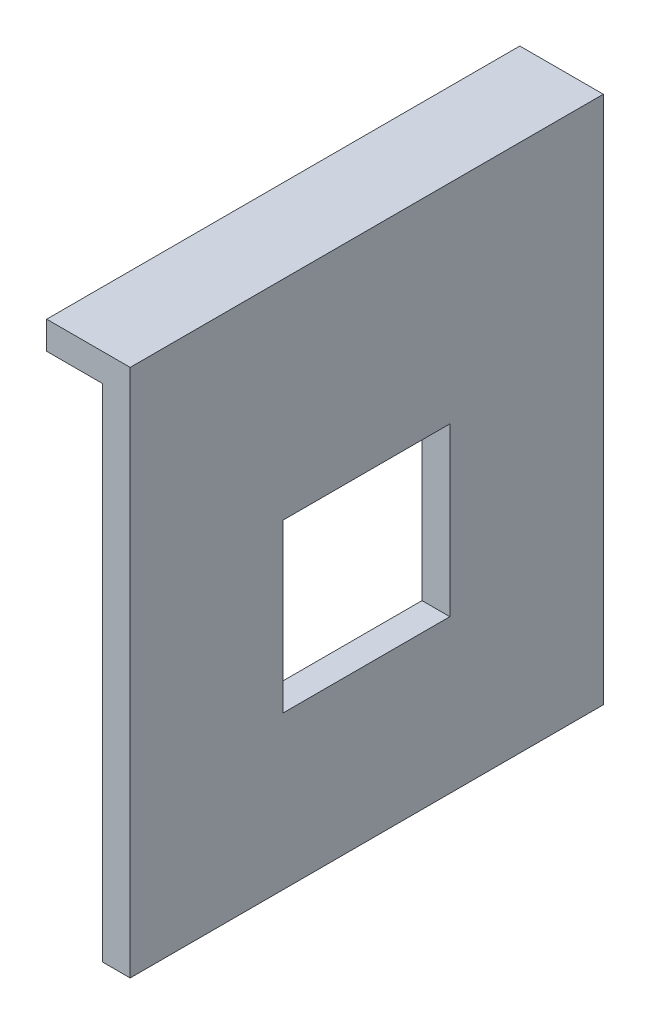
ISO-10303-21;
HEADER;
FILE_DESCRIPTION(('STEP AP214'),'2;1');
FILE_NAME('part.step','',(''),(''),'','','');
FILE_SCHEMA(('AUTOMOTIVE_DESIGN { 1 0 10303 214 1 1 1 1 }'));
ENDSEC;
DATA;
#1=APPLICATION_CONTEXT('core data for automotive mechanical design processes');
#2=APPLICATION_PROTOCOL_DEFINITION('international standard','automotive_design',2000,#1);
#3=PRODUCT_CONTEXT('',#1,'mechanical');
#4=PRODUCT('Part','Part','',(#3));
#5=PRODUCT_RELATED_PRODUCT_CATEGORY('part','',(#4));
#6=PRODUCT_DEFINITION_FORMATION('','',#4);
#7=PRODUCT_DEFINITION_CONTEXT('part definition',#1,'design');
#8=PRODUCT_DEFINITION('design','',#6,#7);
#9=PRODUCT_DEFINITION_SHAPE('','',#8);
#10=(LENGTH_UNIT() NAMED_UNIT(*) SI_UNIT(.MILLI.,.METRE.));
#11=(NAMED_UNIT(*) PLANE_ANGLE_UNIT() SI_UNIT($,.RADIAN.));
#12=(NAMED_UNIT(*) SI_UNIT($,.STERADIAN.) SOLID_ANGLE_UNIT());
#13=UNCERTAINTY_MEASURE_WITH_UNIT(LENGTH_MEASURE(1.E-05),#10,'distance_accuracy_value','');
#14=(GEOMETRIC_REPRESENTATION_CONTEXT(3) GLOBAL_UNCERTAINTY_ASSIGNED_CONTEXT((#13)) GLOBAL_UNIT_ASSIGNED_CONTEXT((#10,
#11,#12)) REPRESENTATION_CONTEXT('',''));
#15=CARTESIAN_POINT('',(0.,0.,0.));
#16=DIRECTION('',(0.,0.,1.));
#17=DIRECTION('',(1.,0.,0.));
#18=AXIS2_PLACEMENT_3D('',#15,#16,#17);
#19=CARTESIAN_POINT('',(-5.,95.,0.));
#20=DIRECTION('',(1.,0.,0.));
#21=DIRECTION('',(0.,0.,-1.));
#22=AXIS2_PLACEMENT_3D('',#19,#20,#21);
#23=PLANE('',#22);
#24=DIRECTION('',(0.,0.,1.));
#25=VECTOR('',#24,1.);
#26=CARTESIAN_POINT('',(-5.,90.,0.));
#27=LINE('',#26,#25);
#28=CARTESIAN_POINT('',(-5.,90.,0.));
#29=VERTEX_POINT('',#28);
#30=CARTESIAN_POINT('',(-4.99999999999999,90.,85.));
#31=VERTEX_POINT('',#30);
#32=EDGE_CURVE('E123',#29,#31,#27,.T.);
#33=ORIENTED_EDGE('',*,*,#32,.F.);
#34=DIRECTION('',(0.,-1.,0.));
#35=VECTOR('',#34,1.);
#36=CARTESIAN_POINT('',(-5.,95.,0.));
#37=LINE('',#36,#35);
#38=CARTESIAN_POINT('',(-5.,0.,0.));
#39=VERTEX_POINT('',#38);
#40=EDGE_CURVE('E187',#29,#39,#37,.T.);
#41=ORIENTED_EDGE('',*,*,#40,.T.);
#42=DIRECTION('',(0.,0.,1.));
#43=VECTOR('',#42,1.);
#44=CARTESIAN_POINT('',(-5.,0.,0.));
#45=LINE('',#44,#43);
#46=CARTESIAN_POINT('',(-4.99999999999999,0.,85.));
#47=VERTEX_POINT('',#46);
#48=EDGE_CURVE('E179',#39,#47,#45,.T.);
#49=ORIENTED_EDGE('',*,*,#48,.T.);
#50=DIRECTION('',(0.,-1.,0.));
#51=VECTOR('',#50,1.);
#52=CARTESIAN_POINT('',(-4.99999999999999,95.,85.));
#53=LINE('',#52,#51);
#54=EDGE_CURVE('E185',#31,#47,#53,.T.);
#55=ORIENTED_EDGE('',*,*,#54,.F.);
#56=EDGE_LOOP('',(#33,#41,#49,#55));
#57=FACE_BOUND('',#56,.T.);
#58=DIRECTION('',(0.,1.,0.));
#59=VECTOR('',#58,1.);
#60=CARTESIAN_POINT('',(-5.,27.5,27.5735931288071));
#61=LINE('',#60,#59);
#62=CARTESIAN_POINT('',(-5.,27.5,27.5735931288071));
#63=VERTEX_POINT('',#62);
#64=CARTESIAN_POINT('',(-5.,57.5,27.5735931288071));
#65=VERTEX_POINT('',#64);
#66=EDGE_CURVE('E57',#63,#65,#61,.T.);
#67=ORIENTED_EDGE('',*,*,#66,.T.);
#68=DIRECTION('',(0.,0.,1.));
#69=VECTOR('',#68,1.);
#70=CARTESIAN_POINT('',(-5.,57.5,27.5735931288071));
#71=LINE('',#70,#69);
#72=CARTESIAN_POINT('',(-4.99999999999999,57.5,57.5735931288071));
#73=VERTEX_POINT('',#72);
#74=EDGE_CURVE('E127',#65,#73,#71,.T.);
#75=ORIENTED_EDGE('',*,*,#74,.T.);
#76=DIRECTION('',(0.,1.,0.));
#77=VECTOR('',#76,1.);
#78=CARTESIAN_POINT('',(-4.99999999999999,27.5,57.5735931288071));
#79=LINE('',#78,#77);
#80=CARTESIAN_POINT('',(-4.99999999999999,27.5,57.5735931288071));
#81=VERTEX_POINT('',#80);
#82=EDGE_CURVE('E133',#81,#73,#79,.T.);
#83=ORIENTED_EDGE('',*,*,#82,.F.);
#84=DIRECTION('',(0.,0.,1.));
#85=VECTOR('',#84,1.);
#86=CARTESIAN_POINT('',(-5.,27.5,27.5735931288071));
#87=LINE('',#86,#85);
#88=EDGE_CURVE('E136',#63,#81,#87,.T.);
#89=ORIENTED_EDGE('',*,*,#88,.F.);
#90=EDGE_LOOP('',(#67,#75,#83,#89));
#91=FACE_BOUND('',#90,.T.);
#92=ADVANCED_FACE('F42',(#57,#91),#23,.F.);
#93=CARTESIAN_POINT('',(0.,95.,0.));
#94=DIRECTION('',(-1.,0.,0.));
#95=DIRECTION('',(0.,0.,1.));
#96=AXIS2_PLACEMENT_3D('',#93,#94,#95);
#97=PLANE('',#96);
#98=DIRECTION('',(0.,0.,-1.));
#99=VECTOR('',#98,1.);
#100=CARTESIAN_POINT('',(0.,0.,0.));
#101=LINE('',#100,#99);
#102=CARTESIAN_POINT('',(0.,0.,85.));
#103=VERTEX_POINT('',#102);
#104=CARTESIAN_POINT('',(0.,0.,0.));
#105=VERTEX_POINT('',#104);
#106=EDGE_CURVE('E164',#103,#105,#101,.T.);
#107=ORIENTED_EDGE('',*,*,#106,.T.);
#108=DIRECTION('',(0.,-1.,0.));
#109=VECTOR('',#108,1.);
#110=CARTESIAN_POINT('',(0.,95.,0.));
#111=LINE('',#110,#109);
#112=CARTESIAN_POINT('',(0.,95.,0.));
#113=VERTEX_POINT('',#112);
#114=EDGE_CURVE('E189',#113,#105,#111,.T.);
#115=ORIENTED_EDGE('',*,*,#114,.F.);
#116=DIRECTION('',(0.,0.,-1.));
#117=VECTOR('',#116,1.);
#118=CARTESIAN_POINT('',(0.,95.,0.));
#119=LINE('',#118,#117);
#120=CARTESIAN_POINT('',(0.,95.,85.));
#121=VERTEX_POINT('',#120);
#122=EDGE_CURVE('E165',#121,#113,#119,.T.);
#123=ORIENTED_EDGE('',*,*,#122,.F.);
#124=DIRECTION('',(0.,-1.,0.));
#125=VECTOR('',#124,1.);
#126=CARTESIAN_POINT('',(0.,95.,85.));
#127=LINE('',#126,#125);
#128=EDGE_CURVE('E173',#121,#103,#127,.T.);
#129=ORIENTED_EDGE('',*,*,#128,.T.);
#130=EDGE_LOOP('',(#107,#115,#123,#129));
#131=FACE_BOUND('',#130,.T.);
#132=DIRECTION('',(0.,1.,0.));
#133=VECTOR('',#132,1.);
#134=CARTESIAN_POINT('',(0.,95.,27.5735931288071));
#135=LINE('',#134,#133);
#136=CARTESIAN_POINT('',(0.,27.5,27.5735931288071));
#137=VERTEX_POINT('',#136);
#138=CARTESIAN_POINT('',(0.,57.5,27.5735931288071));
#139=VERTEX_POINT('',#138);
#140=EDGE_CURVE('E11',#137,#139,#135,.T.);
#141=ORIENTED_EDGE('',*,*,#140,.F.);
#142=DIRECTION('',(0.,0.,1.));
#143=VECTOR('',#142,1.);
#144=CARTESIAN_POINT('',(0.,27.5,0.));
#145=LINE('',#144,#143);
#146=CARTESIAN_POINT('',(0.,27.5,57.5735931288071));
#147=VERTEX_POINT('',#146);
#148=EDGE_CURVE('E192',#137,#147,#145,.T.);
#149=ORIENTED_EDGE('',*,*,#148,.T.);
#150=DIRECTION('',(0.,1.,0.));
#151=VECTOR('',#150,1.);
#152=CARTESIAN_POINT('',(0.,95.,57.5735931288071));
#153=LINE('',#152,#151);
#154=CARTESIAN_POINT('',(0.,57.5,57.5735931288071));
#155=VERTEX_POINT('',#154);
#156=EDGE_CURVE('E195',#147,#155,#153,.T.);
#157=ORIENTED_EDGE('',*,*,#156,.T.);
#158=DIRECTION('',(0.,0.,1.));
#159=VECTOR('',#158,1.);
#160=CARTESIAN_POINT('',(0.,57.5,0.));
#161=LINE('',#160,#159);
#162=EDGE_CURVE('E50',#139,#155,#161,.T.);
#163=ORIENTED_EDGE('',*,*,#162,.F.);
#164=EDGE_LOOP('',(#141,#149,#157,#163));
#165=FACE_BOUND('',#164,.T.);
#166=ADVANCED_FACE('F44',(#131,#165),#97,.F.);
#167=CARTESIAN_POINT('',(0.,95.,0.));
#168=DIRECTION('',(0.,0.,1.));
#169=DIRECTION('',(1.,0.,0.));
#170=AXIS2_PLACEMENT_3D('',#167,#168,#169);
#171=PLANE('',#170);
#172=DIRECTION('',(-1.,0.,0.));
#173=VECTOR('',#172,1.);
#174=CARTESIAN_POINT('',(0.,0.,0.));
#175=LINE('',#174,#173);
#176=EDGE_CURVE('E176',#105,#39,#175,.T.);
#177=ORIENTED_EDGE('',*,*,#176,.T.);
#178=ORIENTED_EDGE('',*,*,#40,.F.);
#179=DIRECTION('',(1.,0.,0.));
#180=VECTOR('',#179,1.);
#181=CARTESIAN_POINT('',(-15.,90.,0.));
#182=LINE('',#181,#180);
#183=CARTESIAN_POINT('',(-15.,90.,0.));
#184=VERTEX_POINT('',#183);
#185=EDGE_CURVE('E161',#184,#29,#182,.T.);
#186=ORIENTED_EDGE('',*,*,#185,.F.);
#187=DIRECTION('',(0.,-1.,0.));
#188=VECTOR('',#187,1.);
#189=CARTESIAN_POINT('',(-15.,95.,0.));
#190=LINE('',#189,#188);
#191=CARTESIAN_POINT('',(-15.,95.,0.));
#192=VERTEX_POINT('',#191);
#193=EDGE_CURVE('E145',#192,#184,#190,.T.);
#194=ORIENTED_EDGE('',*,*,#193,.F.);
#195=DIRECTION('',(-1.,0.,0.));
#196=VECTOR('',#195,1.);
#197=CARTESIAN_POINT('',(0.,95.,0.));
#198=LINE('',#197,#196);
#199=EDGE_CURVE('E168',#113,#192,#198,.T.);
#200=ORIENTED_EDGE('',*,*,#199,.F.);
#201=ORIENTED_EDGE('',*,*,#114,.T.);
#202=EDGE_LOOP('',(#177,#178,#186,#194,#200,#201));
#203=FACE_BOUND('',#202,.T.);
#204=ADVANCED_FACE('F213',(#203),#171,.F.);
#205=CARTESIAN_POINT('',(0.,95.,85.));
#206=DIRECTION('',(0.,0.,-1.));
#207=DIRECTION('',(-1.,0.,0.));
#208=AXIS2_PLACEMENT_3D('',#205,#206,#207);
#209=PLANE('',#208);
#210=DIRECTION('',(1.,0.,0.));
#211=VECTOR('',#210,1.);
#212=CARTESIAN_POINT('',(0.,0.,85.));
#213=LINE('',#212,#211);
#214=EDGE_CURVE('E169',#47,#103,#213,.T.);
#215=ORIENTED_EDGE('',*,*,#214,.T.);
#216=ORIENTED_EDGE('',*,*,#128,.F.);
#217=DIRECTION('',(1.,0.,0.));
#218=VECTOR('',#217,1.);
#219=CARTESIAN_POINT('',(0.,95.,85.));
#220=LINE('',#219,#218);
#221=CARTESIAN_POINT('',(-15.,95.,85.));
#222=VERTEX_POINT('',#221);
#223=EDGE_CURVE('E171',#222,#121,#220,.T.);
#224=ORIENTED_EDGE('',*,*,#223,.F.);
#225=DIRECTION('',(0.,1.,0.));
#226=VECTOR('',#225,1.);
#227=CARTESIAN_POINT('',(-15.,95.,85.));
#228=LINE('',#227,#226);
#229=CARTESIAN_POINT('',(-15.,90.,85.));
#230=VERTEX_POINT('',#229);
#231=EDGE_CURVE('E150',#230,#222,#228,.T.);
#232=ORIENTED_EDGE('',*,*,#231,.F.);
#233=DIRECTION('',(1.,0.,0.));
#234=VECTOR('',#233,1.);
#235=CARTESIAN_POINT('',(-15.,90.,85.));
#236=LINE('',#235,#234);
#237=EDGE_CURVE('E156',#230,#31,#236,.T.);
#238=ORIENTED_EDGE('',*,*,#237,.T.);
#239=ORIENTED_EDGE('',*,*,#54,.T.);
#240=EDGE_LOOP('',(#215,#216,#224,#232,#238,#239));
#241=FACE_BOUND('',#240,.T.);
#242=ADVANCED_FACE('F216',(#241),#209,.F.);
#243=CARTESIAN_POINT('',(0.,95.,0.));
#244=DIRECTION('',(0.,-1.,0.));
#245=DIRECTION('',(0.,0.,-1.));
#246=AXIS2_PLACEMENT_3D('',#243,#244,#245);
#247=PLANE('',#246);
#248=ORIENTED_EDGE('',*,*,#122,.T.);
#249=ORIENTED_EDGE('',*,*,#199,.T.);
#250=DIRECTION('',(0.,0.,-1.));
#251=VECTOR('',#250,1.);
#252=CARTESIAN_POINT('',(-15.,95.,0.));
#253=LINE('',#252,#251);
#254=EDGE_CURVE('E153',#222,#192,#253,.T.);
#255=ORIENTED_EDGE('',*,*,#254,.F.);
#256=ORIENTED_EDGE('',*,*,#223,.T.);
#257=EDGE_LOOP('',(#248,#249,#255,#256));
#258=FACE_BOUND('',#257,.T.);
#259=ADVANCED_FACE('F223',(#258),#247,.F.);
#260=CARTESIAN_POINT('',(0.,0.,0.));
#261=DIRECTION('',(0.,-1.,0.));
#262=DIRECTION('',(0.,0.,-1.));
#263=AXIS2_PLACEMENT_3D('',#260,#261,#262);
#264=PLANE('',#263);
#265=ORIENTED_EDGE('',*,*,#106,.F.);
#266=ORIENTED_EDGE('',*,*,#214,.F.);
#267=ORIENTED_EDGE('',*,*,#48,.F.);
#268=ORIENTED_EDGE('',*,*,#176,.F.);
#269=EDGE_LOOP('',(#265,#266,#267,#268));
#270=FACE_BOUND('',#269,.T.);
#271=ADVANCED_FACE('F232',(#270),#264,.T.);
#272=CARTESIAN_POINT('',(-15.,90.,0.));
#273=DIRECTION('',(0.,1.,0.));
#274=DIRECTION('',(0.,0.,1.));
#275=AXIS2_PLACEMENT_3D('',#272,#273,#274);
#276=PLANE('',#275);
#277=ORIENTED_EDGE('',*,*,#32,.T.);
#278=ORIENTED_EDGE('',*,*,#237,.F.);
#279=DIRECTION('',(0.,0.,1.));
#280=VECTOR('',#279,1.);
#281=CARTESIAN_POINT('',(-15.,90.,0.));
#282=LINE('',#281,#280);
#283=EDGE_CURVE('E148',#184,#230,#282,.T.);
#284=ORIENTED_EDGE('',*,*,#283,.F.);
#285=ORIENTED_EDGE('',*,*,#185,.T.);
#286=EDGE_LOOP('',(#277,#278,#284,#285));
#287=FACE_BOUND('',#286,.T.);
#288=ADVANCED_FACE('F235',(#287),#276,.F.);
#289=CARTESIAN_POINT('',(-15.,0.,0.));
#290=DIRECTION('',(-1.,0.,0.));
#291=DIRECTION('',(0.,0.,1.));
#292=AXIS2_PLACEMENT_3D('',#289,#290,#291);
#293=PLANE('',#292);
#294=ORIENTED_EDGE('',*,*,#193,.T.);
#295=ORIENTED_EDGE('',*,*,#283,.T.);
#296=ORIENTED_EDGE('',*,*,#231,.T.);
#297=ORIENTED_EDGE('',*,*,#254,.T.);
#298=EDGE_LOOP('',(#294,#295,#296,#297));
#299=FACE_BOUND('',#298,.T.);
#300=ADVANCED_FACE('F240',(#299),#293,.T.);
#301=CARTESIAN_POINT('',(5.,27.5,27.5735931288071));
#302=DIRECTION('',(0.,0.,1.));
#303=DIRECTION('',(1.,0.,0.));
#304=AXIS2_PLACEMENT_3D('',#301,#302,#303);
#305=PLANE('',#304);
#306=ORIENTED_EDGE('',*,*,#140,.T.);
#307=DIRECTION('',(-1.,0.,0.));
#308=VECTOR('',#307,1.);
#309=CARTESIAN_POINT('',(5.,57.5,27.5735931288071));
#310=LINE('',#309,#308);
#311=EDGE_CURVE('E117',#139,#65,#310,.T.);
#312=ORIENTED_EDGE('',*,*,#311,.T.);
#313=ORIENTED_EDGE('',*,*,#66,.F.);
#314=DIRECTION('',(-1.,0.,0.));
#315=VECTOR('',#314,1.);
#316=CARTESIAN_POINT('',(5.,27.5,27.5735931288071));
#317=LINE('',#316,#315);
#318=EDGE_CURVE('E141',#137,#63,#317,.T.);
#319=ORIENTED_EDGE('',*,*,#318,.F.);
#320=EDGE_LOOP('',(#306,#312,#313,#319));
#321=FACE_BOUND('',#320,.T.);
#322=ADVANCED_FACE('F119',(#321),#305,.T.);
#323=CARTESIAN_POINT('',(5.,57.5,27.5735931288071));
#324=DIRECTION('',(0.,-1.,0.));
#325=DIRECTION('',(0.,0.,-1.));
#326=AXIS2_PLACEMENT_3D('',#323,#324,#325);
#327=PLANE('',#326);
#328=ORIENTED_EDGE('',*,*,#162,.T.);
#329=DIRECTION('',(-1.,0.,0.));
#330=VECTOR('',#329,1.);
#331=CARTESIAN_POINT('',(5.00000000000001,57.5,57.5735931288071));
#332=LINE('',#331,#330);
#333=EDGE_CURVE('E124',#155,#73,#332,.T.);
#334=ORIENTED_EDGE('',*,*,#333,.T.);
#335=ORIENTED_EDGE('',*,*,#74,.F.);
#336=ORIENTED_EDGE('',*,*,#311,.F.);
#337=EDGE_LOOP('',(#328,#334,#335,#336));
#338=FACE_BOUND('',#337,.T.);
#339=ADVANCED_FACE('F128',(#338),#327,.T.);
#340=CARTESIAN_POINT('',(5.00000000000001,27.5,57.5735931288071));
#341=DIRECTION('',(0.,0.,1.));
#342=DIRECTION('',(1.,0.,0.));
#343=AXIS2_PLACEMENT_3D('',#340,#341,#342);
#344=PLANE('',#343);
#345=DIRECTION('',(-1.,0.,0.));
#346=VECTOR('',#345,1.);
#347=CARTESIAN_POINT('',(5.00000000000001,27.5,57.5735931288071));
#348=LINE('',#347,#346);
#349=EDGE_CURVE('E65',#147,#81,#348,.T.);
#350=ORIENTED_EDGE('',*,*,#349,.T.);
#351=ORIENTED_EDGE('',*,*,#82,.T.);
#352=ORIENTED_EDGE('',*,*,#333,.F.);
#353=ORIENTED_EDGE('',*,*,#156,.F.);
#354=EDGE_LOOP('',(#350,#351,#352,#353));
#355=FACE_BOUND('',#354,.T.);
#356=ADVANCED_FACE('F199',(#355),#344,.F.);
#357=CARTESIAN_POINT('',(5.,27.5,27.5735931288071));
#358=DIRECTION('',(0.,-1.,0.));
#359=DIRECTION('',(0.,0.,-1.));
#360=AXIS2_PLACEMENT_3D('',#357,#358,#359);
#361=PLANE('',#360);
#362=ORIENTED_EDGE('',*,*,#318,.T.);
#363=ORIENTED_EDGE('',*,*,#88,.T.);
#364=ORIENTED_EDGE('',*,*,#349,.F.);
#365=ORIENTED_EDGE('',*,*,#148,.F.);
#366=EDGE_LOOP('',(#362,#363,#364,#365));
#367=FACE_BOUND('',#366,.T.);
#368=ADVANCED_FACE('F200',(#367),#361,.F.);
#369=CLOSED_SHELL('',(#92,#166,#204,#242,#259,#271,#288,#300,#322,#339,#356,#368));
#370=MANIFOLD_SOLID_BREP('B2',#369);
#371=ADVANCED_BREP_SHAPE_REPRESENTATION('',(#18,#370),#14);
#372=SHAPE_DEFINITION_REPRESENTATION(#9,#371);
ENDSEC;
END-ISO-10303-21;
